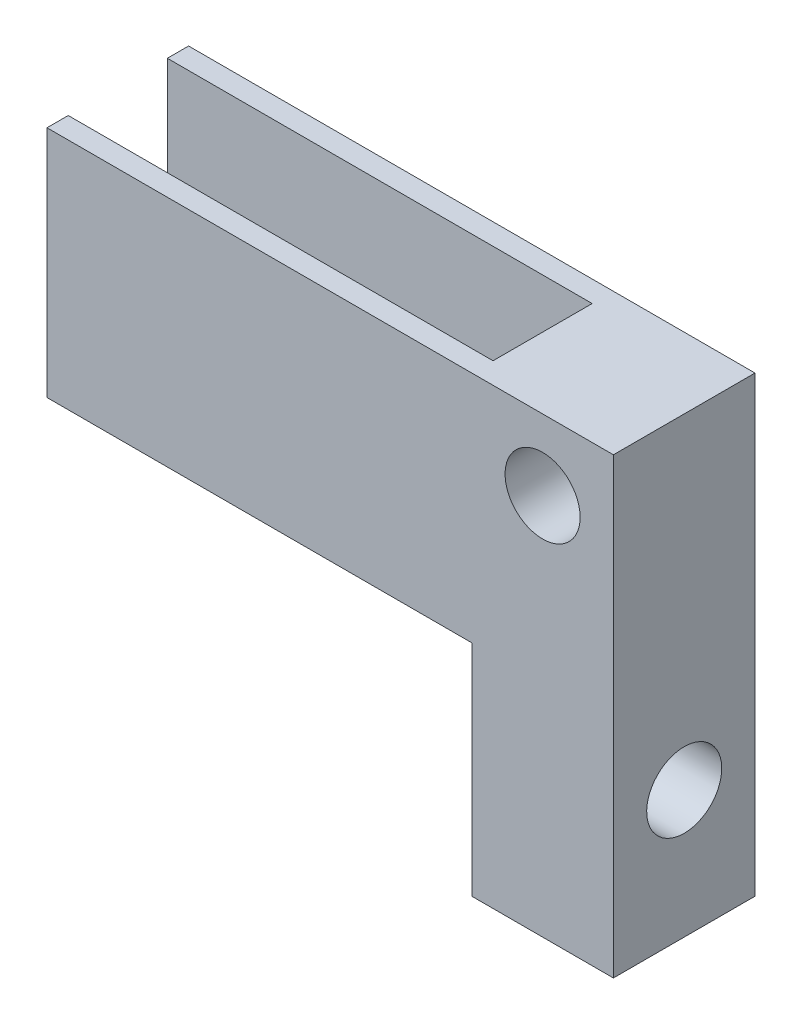
ISO-10303-21;
HEADER;
FILE_DESCRIPTION(('STEP AP214'),'2;1');
FILE_NAME('part.step','',(''),(''),'','','');
FILE_SCHEMA(('AUTOMOTIVE_DESIGN { 1 0 10303 214 1 1 1 1 }'));
ENDSEC;
DATA;
#1=APPLICATION_CONTEXT('core data for automotive mechanical design processes');
#2=APPLICATION_PROTOCOL_DEFINITION('international standard','automotive_design',2000,#1);
#3=PRODUCT_CONTEXT('',#1,'mechanical');
#4=PRODUCT('Part','Part','',(#3));
#5=PRODUCT_RELATED_PRODUCT_CATEGORY('part','',(#4));
#6=PRODUCT_DEFINITION_FORMATION('','',#4);
#7=PRODUCT_DEFINITION_CONTEXT('part definition',#1,'design');
#8=PRODUCT_DEFINITION('design','',#6,#7);
#9=PRODUCT_DEFINITION_SHAPE('','',#8);
#10=(LENGTH_UNIT() NAMED_UNIT(*) SI_UNIT(.MILLI.,.METRE.));
#11=(NAMED_UNIT(*) PLANE_ANGLE_UNIT() SI_UNIT($,.RADIAN.));
#12=(NAMED_UNIT(*) SI_UNIT($,.STERADIAN.) SOLID_ANGLE_UNIT());
#13=UNCERTAINTY_MEASURE_WITH_UNIT(LENGTH_MEASURE(1.E-05),#10,'distance_accuracy_value','');
#14=(GEOMETRIC_REPRESENTATION_CONTEXT(3) GLOBAL_UNCERTAINTY_ASSIGNED_CONTEXT((#13)) GLOBAL_UNIT_ASSIGNED_CONTEXT((#10,
#11,#12)) REPRESENTATION_CONTEXT('',''));
#15=CARTESIAN_POINT('',(0.,0.,0.));
#16=DIRECTION('',(0.,0.,1.));
#17=DIRECTION('',(1.,0.,0.));
#18=AXIS2_PLACEMENT_3D('',#15,#16,#17);
#19=CARTESIAN_POINT('',(0.,0.,10.));
#20=DIRECTION('',(-1.,0.,0.));
#21=DIRECTION('',(0.,-1.,0.));
#22=AXIS2_PLACEMENT_3D('',#19,#20,#21);
#23=PLANE('',#22);
#24=DIRECTION('',(0.,0.,1.));
#25=VECTOR('',#24,1.);
#26=CARTESIAN_POINT('',(0.,32.,10.));
#27=LINE('',#26,#25);
#28=CARTESIAN_POINT('',(0.,32.,1.5));
#29=VERTEX_POINT('',#28);
#30=CARTESIAN_POINT('',(0.,32.,8.5));
#31=VERTEX_POINT('',#30);
#32=EDGE_CURVE('E199',#29,#31,#27,.T.);
#33=ORIENTED_EDGE('',*,*,#32,.F.);
#34=DIRECTION('',(0.,1.,0.));
#35=VECTOR('',#34,1.);
#36=CARTESIAN_POINT('',(0.,36.5,1.5));
#37=LINE('',#36,#35);
#38=CARTESIAN_POINT('',(0.,15.5,1.5));
#39=VERTEX_POINT('',#38);
#40=EDGE_CURVE('E186',#39,#29,#37,.T.);
#41=ORIENTED_EDGE('',*,*,#40,.F.);
#42=DIRECTION('',(0.,0.,1.));
#43=VECTOR('',#42,1.);
#44=CARTESIAN_POINT('',(0.,15.5,1.5));
#45=LINE('',#44,#43);
#46=CARTESIAN_POINT('',(0.,15.5,0.));
#47=VERTEX_POINT('',#46);
#48=EDGE_CURVE('E117',#47,#39,#45,.T.);
#49=ORIENTED_EDGE('',*,*,#48,.F.);
#50=DIRECTION('',(0.,1.,0.));
#51=VECTOR('',#50,1.);
#52=CARTESIAN_POINT('',(0.,0.,0.));
#53=LINE('',#52,#51);
#54=CARTESIAN_POINT('',(0.,0.,0.));
#55=VERTEX_POINT('',#54);
#56=EDGE_CURVE('E138',#55,#47,#53,.T.);
#57=ORIENTED_EDGE('',*,*,#56,.F.);
#58=DIRECTION('',(0.,0.,-1.));
#59=VECTOR('',#58,1.);
#60=CARTESIAN_POINT('',(0.,0.,10.));
#61=LINE('',#60,#59);
#62=CARTESIAN_POINT('',(0.,0.,10.));
#63=VERTEX_POINT('',#62);
#64=EDGE_CURVE('E43',#63,#55,#61,.T.);
#65=ORIENTED_EDGE('',*,*,#64,.F.);
#66=DIRECTION('',(0.,1.,0.));
#67=VECTOR('',#66,1.);
#68=CARTESIAN_POINT('',(0.,0.,10.));
#69=LINE('',#68,#67);
#70=CARTESIAN_POINT('',(0.,15.5,10.));
#71=VERTEX_POINT('',#70);
#72=EDGE_CURVE('E57',#63,#71,#69,.T.);
#73=ORIENTED_EDGE('',*,*,#72,.T.);
#74=DIRECTION('',(0.,0.,1.));
#75=VECTOR('',#74,1.);
#76=CARTESIAN_POINT('',(0.,15.5,8.5));
#77=LINE('',#76,#75);
#78=CARTESIAN_POINT('',(0.,15.5,8.5));
#79=VERTEX_POINT('',#78);
#80=EDGE_CURVE('E170',#79,#71,#77,.T.);
#81=ORIENTED_EDGE('',*,*,#80,.F.);
#82=DIRECTION('',(0.,-1.,0.));
#83=VECTOR('',#82,1.);
#84=CARTESIAN_POINT('',(0.,36.5,8.5));
#85=LINE('',#84,#83);
#86=EDGE_CURVE('E173',#31,#79,#85,.T.);
#87=ORIENTED_EDGE('',*,*,#86,.F.);
#88=EDGE_LOOP('',(#33,#41,#49,#57,#65,#73,#81,#87));
#89=FACE_BOUND('',#88,.T.);
#90=CARTESIAN_POINT('',(0.,9.,5.));
#91=DIRECTION('',(-1.,0.,0.));
#92=DIRECTION('',(0.,-1.,0.));
#93=AXIS2_PLACEMENT_3D('',#90,#91,#92);
#94=CIRCLE('',#93,2.65);
#95=CARTESIAN_POINT('',(0.,6.35,5.));
#96=VERTEX_POINT('',#95);
#97=EDGE_CURVE('E158',#96,#96,#94,.T.);
#98=ORIENTED_EDGE('',*,*,#97,.F.);
#99=EDGE_LOOP('',(#98));
#100=FACE_BOUND('',#99,.T.);
#101=ADVANCED_FACE('F35',(#89,#100),#23,.T.);
#102=CARTESIAN_POINT('',(9.99999999999999,50.,10.));
#103=DIRECTION('',(1.,0.,0.));
#104=DIRECTION('',(0.,1.,0.));
#105=AXIS2_PLACEMENT_3D('',#102,#103,#104);
#106=PLANE('',#105);
#107=DIRECTION('',(0.,0.,-1.));
#108=VECTOR('',#107,1.);
#109=CARTESIAN_POINT('',(9.99999999999999,32.,10.));
#110=LINE('',#109,#108);
#111=CARTESIAN_POINT('',(9.99999999999998,32.,10.));
#112=VERTEX_POINT('',#111);
#113=CARTESIAN_POINT('',(9.99999999999998,32.,0.));
#114=VERTEX_POINT('',#113);
#115=EDGE_CURVE('E110',#112,#114,#110,.T.);
#116=ORIENTED_EDGE('',*,*,#115,.F.);
#117=DIRECTION('',(0.,-1.,0.));
#118=VECTOR('',#117,1.);
#119=CARTESIAN_POINT('',(9.99999999999999,50.,10.));
#120=LINE('',#119,#118);
#121=CARTESIAN_POINT('',(10.,0.,10.));
#122=VERTEX_POINT('',#121);
#123=EDGE_CURVE('E148',#112,#122,#120,.T.);
#124=ORIENTED_EDGE('',*,*,#123,.T.);
#125=DIRECTION('',(0.,0.,-1.));
#126=VECTOR('',#125,1.);
#127=CARTESIAN_POINT('',(10.,0.,10.));
#128=LINE('',#127,#126);
#129=CARTESIAN_POINT('',(10.,0.,0.));
#130=VERTEX_POINT('',#129);
#131=EDGE_CURVE('E133',#122,#130,#128,.T.);
#132=ORIENTED_EDGE('',*,*,#131,.T.);
#133=DIRECTION('',(0.,-1.,0.));
#134=VECTOR('',#133,1.);
#135=CARTESIAN_POINT('',(9.99999999999999,50.,0.));
#136=LINE('',#135,#134);
#137=EDGE_CURVE('E125',#114,#130,#136,.T.);
#138=ORIENTED_EDGE('',*,*,#137,.F.);
#139=EDGE_LOOP('',(#116,#124,#132,#138));
#140=FACE_BOUND('',#139,.T.);
#141=CARTESIAN_POINT('',(10.,9.,5.));
#142=DIRECTION('',(-1.,0.,0.));
#143=DIRECTION('',(0.,-1.,0.));
#144=AXIS2_PLACEMENT_3D('',#141,#142,#143);
#145=CIRCLE('',#144,2.65);
#146=CARTESIAN_POINT('',(10.,6.35,5.));
#147=VERTEX_POINT('',#146);
#148=EDGE_CURVE('E156',#147,#147,#145,.T.);
#149=ORIENTED_EDGE('',*,*,#148,.T.);
#150=EDGE_LOOP('',(#149));
#151=FACE_BOUND('',#150,.T.);
#152=ADVANCED_FACE('F37',(#140,#151),#106,.T.);
#153=CARTESIAN_POINT('',(10.,0.,10.));
#154=DIRECTION('',(0.,-1.,0.));
#155=DIRECTION('',(1.,0.,0.));
#156=AXIS2_PLACEMENT_3D('',#153,#154,#155);
#157=PLANE('',#156);
#158=DIRECTION('',(-1.,0.,0.));
#159=VECTOR('',#158,1.);
#160=CARTESIAN_POINT('',(10.,0.,0.));
#161=LINE('',#160,#159);
#162=EDGE_CURVE('E135',#130,#55,#161,.T.);
#163=ORIENTED_EDGE('',*,*,#162,.F.);
#164=ORIENTED_EDGE('',*,*,#131,.F.);
#165=DIRECTION('',(-1.,0.,0.));
#166=VECTOR('',#165,1.);
#167=CARTESIAN_POINT('',(10.,0.,10.));
#168=LINE('',#167,#166);
#169=EDGE_CURVE('E149',#122,#63,#168,.T.);
#170=ORIENTED_EDGE('',*,*,#169,.T.);
#171=ORIENTED_EDGE('',*,*,#64,.T.);
#172=EDGE_LOOP('',(#163,#164,#170,#171));
#173=FACE_BOUND('',#172,.T.);
#174=ADVANCED_FACE('F230',(#173),#157,.T.);
#175=CARTESIAN_POINT('',(0.,0.,10.));
#176=DIRECTION('',(0.,0.,-1.));
#177=DIRECTION('',(-1.,0.,0.));
#178=AXIS2_PLACEMENT_3D('',#175,#176,#177);
#179=PLANE('',#178);
#180=CARTESIAN_POINT('',(4.99999999999999,27.,10.));
#181=DIRECTION('',(0.,0.,1.));
#182=DIRECTION('',(1.,0.,0.));
#183=AXIS2_PLACEMENT_3D('',#180,#181,#182);
#184=CIRCLE('',#183,2.65);
#185=CARTESIAN_POINT('',(7.64999999999999,27.,10.));
#186=VERTEX_POINT('',#185);
#187=EDGE_CURVE('E141',#186,#186,#184,.T.);
#188=ORIENTED_EDGE('',*,*,#187,.F.);
#189=EDGE_LOOP('',(#188));
#190=FACE_BOUND('',#189,.T.);
#191=ORIENTED_EDGE('',*,*,#123,.F.);
#192=DIRECTION('',(1.,0.,0.));
#193=VECTOR('',#192,1.);
#194=CARTESIAN_POINT('',(-34.1391826025117,32.,10.));
#195=LINE('',#194,#193);
#196=CARTESIAN_POINT('',(-30.,32.,10.));
#197=VERTEX_POINT('',#196);
#198=EDGE_CURVE('E113',#197,#112,#195,.T.);
#199=ORIENTED_EDGE('',*,*,#198,.F.);
#200=DIRECTION('',(0.,1.,0.));
#201=VECTOR('',#200,1.);
#202=CARTESIAN_POINT('',(-30.,15.5,10.));
#203=LINE('',#202,#201);
#204=CARTESIAN_POINT('',(-30.,15.5,10.));
#205=VERTEX_POINT('',#204);
#206=EDGE_CURVE('E169',#205,#197,#203,.T.);
#207=ORIENTED_EDGE('',*,*,#206,.F.);
#208=DIRECTION('',(1.,0.,0.));
#209=VECTOR('',#208,1.);
#210=CARTESIAN_POINT('',(-30.,15.5,10.));
#211=LINE('',#210,#209);
#212=EDGE_CURVE('E166',#205,#71,#211,.T.);
#213=ORIENTED_EDGE('',*,*,#212,.T.);
#214=ORIENTED_EDGE('',*,*,#72,.F.);
#215=ORIENTED_EDGE('',*,*,#169,.F.);
#216=EDGE_LOOP('',(#191,#199,#207,#213,#214,#215));
#217=FACE_BOUND('',#216,.T.);
#218=ADVANCED_FACE('F229',(#190,#217),#179,.F.);
#219=CARTESIAN_POINT('',(0.,0.,0.));
#220=DIRECTION('',(0.,0.,-1.));
#221=DIRECTION('',(-1.,0.,0.));
#222=AXIS2_PLACEMENT_3D('',#219,#220,#221);
#223=PLANE('',#222);
#224=DIRECTION('',(1.,0.,0.));
#225=VECTOR('',#224,1.);
#226=CARTESIAN_POINT('',(-34.1391826025117,32.,0.));
#227=LINE('',#226,#225);
#228=CARTESIAN_POINT('',(-30.,32.,0.));
#229=VERTEX_POINT('',#228);
#230=EDGE_CURVE('E50',#229,#114,#227,.T.);
#231=ORIENTED_EDGE('',*,*,#230,.T.);
#232=ORIENTED_EDGE('',*,*,#137,.T.);
#233=ORIENTED_EDGE('',*,*,#162,.T.);
#234=ORIENTED_EDGE('',*,*,#56,.T.);
#235=DIRECTION('',(1.,0.,0.));
#236=VECTOR('',#235,1.);
#237=CARTESIAN_POINT('',(-30.,15.5,0.));
#238=LINE('',#237,#236);
#239=CARTESIAN_POINT('',(-30.,15.5,0.));
#240=VERTEX_POINT('',#239);
#241=EDGE_CURVE('E175',#240,#47,#238,.T.);
#242=ORIENTED_EDGE('',*,*,#241,.F.);
#243=DIRECTION('',(0.,-1.,0.));
#244=VECTOR('',#243,1.);
#245=CARTESIAN_POINT('',(-30.,15.5,0.));
#246=LINE('',#245,#244);
#247=EDGE_CURVE('E128',#229,#240,#246,.T.);
#248=ORIENTED_EDGE('',*,*,#247,.F.);
#249=EDGE_LOOP('',(#231,#232,#233,#234,#242,#248));
#250=FACE_BOUND('',#249,.T.);
#251=CARTESIAN_POINT('',(4.99999999999999,27.,0.));
#252=DIRECTION('',(0.,0.,1.));
#253=DIRECTION('',(1.,0.,0.));
#254=AXIS2_PLACEMENT_3D('',#251,#252,#253);
#255=CIRCLE('',#254,2.65);
#256=CARTESIAN_POINT('',(7.64999999999999,27.,0.));
#257=VERTEX_POINT('',#256);
#258=EDGE_CURVE('E136',#257,#257,#255,.T.);
#259=ORIENTED_EDGE('',*,*,#258,.T.);
#260=EDGE_LOOP('',(#259));
#261=FACE_BOUND('',#260,.T.);
#262=ADVANCED_FACE('F122',(#250,#261),#223,.T.);
#263=CARTESIAN_POINT('',(4.99999999999999,27.,0.));
#264=DIRECTION('',(0.,0.,1.));
#265=DIRECTION('',(1.,0.,0.));
#266=AXIS2_PLACEMENT_3D('',#263,#264,#265);
#267=CYLINDRICAL_SURFACE('',#266,2.65);
#268=ORIENTED_EDGE('',*,*,#258,.F.);
#269=EDGE_LOOP('',(#268));
#270=FACE_BOUND('',#269,.T.);
#271=ORIENTED_EDGE('',*,*,#187,.T.);
#272=EDGE_LOOP('',(#271));
#273=FACE_BOUND('',#272,.T.);
#274=ADVANCED_FACE('F257',(#270,#273),#267,.F.);
#275=CARTESIAN_POINT('',(10.,9.,5.));
#276=DIRECTION('',(-1.,0.,0.));
#277=DIRECTION('',(0.,-1.,0.));
#278=AXIS2_PLACEMENT_3D('',#275,#276,#277);
#279=CYLINDRICAL_SURFACE('',#278,2.65);
#280=ORIENTED_EDGE('',*,*,#148,.F.);
#281=EDGE_LOOP('',(#280));
#282=FACE_BOUND('',#281,.T.);
#283=ORIENTED_EDGE('',*,*,#97,.T.);
#284=EDGE_LOOP('',(#283));
#285=FACE_BOUND('',#284,.T.);
#286=ADVANCED_FACE('F240',(#282,#285),#279,.F.);
#287=CARTESIAN_POINT('',(-30.,36.5,8.5));
#288=DIRECTION('',(0.,0.,1.));
#289=DIRECTION('',(0.,-1.,0.));
#290=AXIS2_PLACEMENT_3D('',#287,#288,#289);
#291=PLANE('',#290);
#292=DIRECTION('',(0.,-1.,0.));
#293=VECTOR('',#292,1.);
#294=CARTESIAN_POINT('',(-30.,36.5,8.5));
#295=LINE('',#294,#293);
#296=CARTESIAN_POINT('',(-30.,32.,8.5));
#297=VERTEX_POINT('',#296);
#298=CARTESIAN_POINT('',(-30.,15.5,8.5));
#299=VERTEX_POINT('',#298);
#300=EDGE_CURVE('E172',#297,#299,#295,.T.);
#301=ORIENTED_EDGE('',*,*,#300,.F.);
#302=DIRECTION('',(1.,0.,0.));
#303=VECTOR('',#302,1.);
#304=CARTESIAN_POINT('',(-30.,32.,8.5));
#305=LINE('',#304,#303);
#306=EDGE_CURVE('E196',#297,#31,#305,.T.);
#307=ORIENTED_EDGE('',*,*,#306,.T.);
#308=ORIENTED_EDGE('',*,*,#86,.T.);
#309=DIRECTION('',(1.,0.,0.));
#310=VECTOR('',#309,1.);
#311=CARTESIAN_POINT('',(-30.,15.5,8.5));
#312=LINE('',#311,#310);
#313=EDGE_CURVE('E161',#299,#79,#312,.T.);
#314=ORIENTED_EDGE('',*,*,#313,.F.);
#315=EDGE_LOOP('',(#301,#307,#308,#314));
#316=FACE_BOUND('',#315,.T.);
#317=ADVANCED_FACE('F221',(#316),#291,.F.);
#318=CARTESIAN_POINT('',(-30.,15.5,8.5));
#319=DIRECTION('',(0.,1.,0.));
#320=DIRECTION('',(0.,0.,1.));
#321=AXIS2_PLACEMENT_3D('',#318,#319,#320);
#322=PLANE('',#321);
#323=ORIENTED_EDGE('',*,*,#80,.T.);
#324=ORIENTED_EDGE('',*,*,#212,.F.);
#325=DIRECTION('',(0.,0.,1.));
#326=VECTOR('',#325,1.);
#327=CARTESIAN_POINT('',(-30.,15.5,8.5));
#328=LINE('',#327,#326);
#329=EDGE_CURVE('E178',#299,#205,#328,.T.);
#330=ORIENTED_EDGE('',*,*,#329,.F.);
#331=ORIENTED_EDGE('',*,*,#313,.T.);
#332=EDGE_LOOP('',(#323,#324,#330,#331));
#333=FACE_BOUND('',#332,.T.);
#334=ADVANCED_FACE('F232',(#333),#322,.F.);
#335=CARTESIAN_POINT('',(-30.,0.,0.));
#336=DIRECTION('',(-1.,0.,0.));
#337=DIRECTION('',(0.,-1.,0.));
#338=AXIS2_PLACEMENT_3D('',#335,#336,#337);
#339=PLANE('',#338);
#340=DIRECTION('',(0.,0.,1.));
#341=VECTOR('',#340,1.);
#342=CARTESIAN_POINT('',(-30.,32.,0.));
#343=LINE('',#342,#341);
#344=EDGE_CURVE('E118',#297,#197,#343,.T.);
#345=ORIENTED_EDGE('',*,*,#344,.F.);
#346=ORIENTED_EDGE('',*,*,#300,.T.);
#347=ORIENTED_EDGE('',*,*,#329,.T.);
#348=ORIENTED_EDGE('',*,*,#206,.T.);
#349=EDGE_LOOP('',(#345,#346,#347,#348));
#350=FACE_BOUND('',#349,.T.);
#351=ADVANCED_FACE('F225',(#350),#339,.T.);
#352=CARTESIAN_POINT('',(-30.,15.5,1.5));
#353=DIRECTION('',(0.,1.,0.));
#354=DIRECTION('',(-1.,0.,0.));
#355=AXIS2_PLACEMENT_3D('',#352,#353,#354);
#356=PLANE('',#355);
#357=ORIENTED_EDGE('',*,*,#48,.T.);
#358=DIRECTION('',(1.,0.,0.));
#359=VECTOR('',#358,1.);
#360=CARTESIAN_POINT('',(-30.,15.5,1.5));
#361=LINE('',#360,#359);
#362=CARTESIAN_POINT('',(-30.,15.5,1.5));
#363=VERTEX_POINT('',#362);
#364=EDGE_CURVE('E182',#363,#39,#361,.T.);
#365=ORIENTED_EDGE('',*,*,#364,.F.);
#366=DIRECTION('',(0.,0.,1.));
#367=VECTOR('',#366,1.);
#368=CARTESIAN_POINT('',(-30.,15.5,1.5));
#369=LINE('',#368,#367);
#370=EDGE_CURVE('E192',#240,#363,#369,.T.);
#371=ORIENTED_EDGE('',*,*,#370,.F.);
#372=ORIENTED_EDGE('',*,*,#241,.T.);
#373=EDGE_LOOP('',(#357,#365,#371,#372));
#374=FACE_BOUND('',#373,.T.);
#375=ADVANCED_FACE('F213',(#374),#356,.F.);
#376=CARTESIAN_POINT('',(-30.,36.5,1.5));
#377=DIRECTION('',(0.,0.,-1.));
#378=DIRECTION('',(0.,1.,0.));
#379=AXIS2_PLACEMENT_3D('',#376,#377,#378);
#380=PLANE('',#379);
#381=ORIENTED_EDGE('',*,*,#40,.T.);
#382=DIRECTION('',(-1.,0.,0.));
#383=VECTOR('',#382,1.);
#384=CARTESIAN_POINT('',(-30.,32.,1.5));
#385=LINE('',#384,#383);
#386=CARTESIAN_POINT('',(-30.,32.,1.5));
#387=VERTEX_POINT('',#386);
#388=EDGE_CURVE('E129',#29,#387,#385,.T.);
#389=ORIENTED_EDGE('',*,*,#388,.T.);
#390=DIRECTION('',(0.,1.,0.));
#391=VECTOR('',#390,1.);
#392=CARTESIAN_POINT('',(-30.,36.5,1.5));
#393=LINE('',#392,#391);
#394=EDGE_CURVE('E185',#363,#387,#393,.T.);
#395=ORIENTED_EDGE('',*,*,#394,.F.);
#396=ORIENTED_EDGE('',*,*,#364,.T.);
#397=EDGE_LOOP('',(#381,#389,#395,#396));
#398=FACE_BOUND('',#397,.T.);
#399=ADVANCED_FACE('F205',(#398),#380,.F.);
#400=CARTESIAN_POINT('',(-30.,0.,0.));
#401=DIRECTION('',(1.,0.,0.));
#402=DIRECTION('',(0.,1.,0.));
#403=AXIS2_PLACEMENT_3D('',#400,#401,#402);
#404=PLANE('',#403);
#405=ORIENTED_EDGE('',*,*,#394,.T.);
#406=DIRECTION('',(0.,0.,-1.));
#407=VECTOR('',#406,1.);
#408=CARTESIAN_POINT('',(-30.,32.,0.));
#409=LINE('',#408,#407);
#410=EDGE_CURVE('E11',#387,#229,#409,.T.);
#411=ORIENTED_EDGE('',*,*,#410,.T.);
#412=ORIENTED_EDGE('',*,*,#247,.T.);
#413=ORIENTED_EDGE('',*,*,#370,.T.);
#414=EDGE_LOOP('',(#405,#411,#412,#413));
#415=FACE_BOUND('',#414,.T.);
#416=ADVANCED_FACE('F209',(#415),#404,.F.);
#417=CARTESIAN_POINT('',(-34.1391826025117,32.,0.));
#418=DIRECTION('',(0.,-1.,0.));
#419=DIRECTION('',(0.,0.,-1.));
#420=AXIS2_PLACEMENT_3D('',#417,#418,#419);
#421=PLANE('',#420);
#422=ORIENTED_EDGE('',*,*,#115,.T.);
#423=ORIENTED_EDGE('',*,*,#230,.F.);
#424=ORIENTED_EDGE('',*,*,#410,.F.);
#425=ORIENTED_EDGE('',*,*,#388,.F.);
#426=ORIENTED_EDGE('',*,*,#32,.T.);
#427=ORIENTED_EDGE('',*,*,#306,.F.);
#428=ORIENTED_EDGE('',*,*,#344,.T.);
#429=ORIENTED_EDGE('',*,*,#198,.T.);
#430=EDGE_LOOP('',(#422,#423,#424,#425,#426,#427,#428,#429));
#431=FACE_BOUND('',#430,.T.);
#432=ADVANCED_FACE('F111',(#431),#421,.F.);
#433=CLOSED_SHELL('',(#101,#152,#174,#218,#262,#274,#286,#317,#334,#351,#375,#399,#416,#432));
#434=MANIFOLD_SOLID_BREP('B2',#433);
#435=ADVANCED_BREP_SHAPE_REPRESENTATION('',(#18,#434),#14);
#436=SHAPE_DEFINITION_REPRESENTATION(#9,#435);
ENDSEC;
END-ISO-10303-21;
